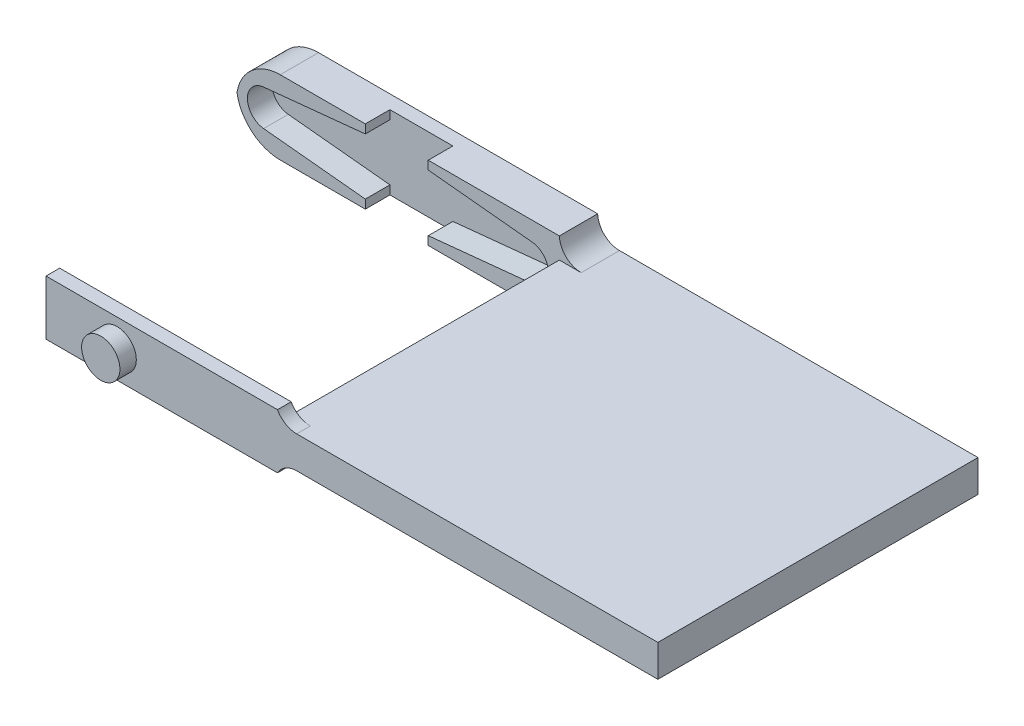
ISO-10303-21;
HEADER;
FILE_DESCRIPTION(('STEP AP214'),'2;1');
FILE_NAME('part.step','',(''),(''),'','','');
FILE_SCHEMA(('AUTOMOTIVE_DESIGN { 1 0 10303 214 1 1 1 1 }'));
ENDSEC;
DATA;
#1=APPLICATION_CONTEXT('core data for automotive mechanical design processes');
#2=APPLICATION_PROTOCOL_DEFINITION('international standard','automotive_design',2000,#1);
#3=PRODUCT_CONTEXT('',#1,'mechanical');
#4=PRODUCT('Part','Part','',(#3));
#5=PRODUCT_RELATED_PRODUCT_CATEGORY('part','',(#4));
#6=PRODUCT_DEFINITION_FORMATION('','',#4);
#7=PRODUCT_DEFINITION_CONTEXT('part definition',#1,'design');
#8=PRODUCT_DEFINITION('design','',#6,#7);
#9=PRODUCT_DEFINITION_SHAPE('','',#8);
#10=(LENGTH_UNIT() NAMED_UNIT(*) SI_UNIT(.MILLI.,.METRE.));
#11=(NAMED_UNIT(*) PLANE_ANGLE_UNIT() SI_UNIT($,.RADIAN.));
#12=(NAMED_UNIT(*) SI_UNIT($,.STERADIAN.) SOLID_ANGLE_UNIT());
#13=UNCERTAINTY_MEASURE_WITH_UNIT(LENGTH_MEASURE(1.E-05),#10,'distance_accuracy_value','');
#14=(GEOMETRIC_REPRESENTATION_CONTEXT(3) GLOBAL_UNCERTAINTY_ASSIGNED_CONTEXT((#13)) GLOBAL_UNIT_ASSIGNED_CONTEXT((#10,
#11,#12)) REPRESENTATION_CONTEXT('',''));
#15=CARTESIAN_POINT('',(0.,0.,0.));
#16=DIRECTION('',(0.,0.,1.));
#17=DIRECTION('',(1.,0.,0.));
#18=AXIS2_PLACEMENT_3D('',#15,#16,#17);
#19=CARTESIAN_POINT('',(0.,0.,29.25));
#20=DIRECTION('',(0.,0.,1.));
#21=DIRECTION('',(1.,0.,0.));
#22=AXIS2_PLACEMENT_3D('',#19,#20,#21);
#23=PLANE('',#22);
#24=DIRECTION('',(1.,0.,0.));
#25=VECTOR('',#24,1.);
#26=CARTESIAN_POINT('',(0.,4.83707186120483,29.25));
#27=LINE('',#26,#25);
#28=CARTESIAN_POINT('',(16.5034017605437,4.83707186120483,29.25));
#29=VERTEX_POINT('',#28);
#30=CARTESIAN_POINT('',(49.5,4.83707186120483,29.25));
#31=VERTEX_POINT('',#30);
#32=EDGE_CURVE('E509',#29,#31,#27,.T.);
#33=ORIENTED_EDGE('',*,*,#32,.F.);
#34=CARTESIAN_POINT('',(16.5034017605437,6.83707186120483,29.25));
#35=DIRECTION('',(0.,0.,1.));
#36=DIRECTION('',(1.,0.,0.));
#37=AXIS2_PLACEMENT_3D('',#34,#35,#36);
#38=CIRCLE('',#37,2.);
#39=CARTESIAN_POINT('',(14.75,5.87500000000001,29.25));
#40=VERTEX_POINT('',#39);
#41=EDGE_CURVE('E445',#29,#40,#38,.F.);
#42=ORIENTED_EDGE('',*,*,#41,.T.);
#43=DIRECTION('',(1.,0.,0.));
#44=VECTOR('',#43,1.);
#45=CARTESIAN_POINT('',(0.,5.87500000000001,29.25));
#46=LINE('',#45,#44);
#47=CARTESIAN_POINT('',(-6.4,5.875,29.25));
#48=VERTEX_POINT('',#47);
#49=EDGE_CURVE('E470',#48,#40,#46,.T.);
#50=ORIENTED_EDGE('',*,*,#49,.F.);
#51=DIRECTION('',(0.,-1.,0.));
#52=VECTOR('',#51,1.);
#53=CARTESIAN_POINT('',(-6.4,0.,29.25));
#54=LINE('',#53,#52);
#55=CARTESIAN_POINT('',(-6.4,0.875000000000003,29.25));
#56=VERTEX_POINT('',#55);
#57=EDGE_CURVE('E473',#48,#56,#54,.T.);
#58=ORIENTED_EDGE('',*,*,#57,.T.);
#59=DIRECTION('',(1.,0.,0.));
#60=VECTOR('',#59,1.);
#61=CARTESIAN_POINT('',(0.,0.875000000000003,29.25));
#62=LINE('',#61,#60);
#63=CARTESIAN_POINT('',(14.75,0.875000000000003,29.25));
#64=VERTEX_POINT('',#63);
#65=EDGE_CURVE('E488',#56,#64,#62,.T.);
#66=ORIENTED_EDGE('',*,*,#65,.T.);
#67=CARTESIAN_POINT('',(16.5034017605437,-0.0870718612048299,29.25));
#68=DIRECTION('',(0.,0.,1.));
#69=DIRECTION('',(1.,0.,0.));
#70=AXIS2_PLACEMENT_3D('',#67,#68,#69);
#71=CIRCLE('',#70,2.);
#72=CARTESIAN_POINT('',(16.5034017605437,1.91292813879517,29.25));
#73=VERTEX_POINT('',#72);
#74=EDGE_CURVE('E449',#64,#73,#71,.F.);
#75=ORIENTED_EDGE('',*,*,#74,.T.);
#76=DIRECTION('',(1.,0.,0.));
#77=VECTOR('',#76,1.);
#78=CARTESIAN_POINT('',(0.,1.91292813879517,29.25));
#79=LINE('',#78,#77);
#80=CARTESIAN_POINT('',(49.5,1.91292813879517,29.25));
#81=VERTEX_POINT('',#80);
#82=EDGE_CURVE('E511',#73,#81,#79,.T.);
#83=ORIENTED_EDGE('',*,*,#82,.T.);
#84=DIRECTION('',(0.,-1.,0.));
#85=VECTOR('',#84,1.);
#86=CARTESIAN_POINT('',(49.5,0.,29.25));
#87=LINE('',#86,#85);
#88=EDGE_CURVE('E513',#31,#81,#87,.T.);
#89=ORIENTED_EDGE('',*,*,#88,.F.);
#90=EDGE_LOOP('',(#33,#42,#50,#58,#66,#75,#83,#89));
#91=FACE_BOUND('',#90,.T.);
#92=CARTESIAN_POINT('',(0.102107464173345,3.37499999999948,29.25));
#93=DIRECTION('',(0.,0.,1.));
#94=DIRECTION('',(1.,0.,0.));
#95=AXIS2_PLACEMENT_3D('',#92,#93,#94);
#96=CIRCLE('',#95,1.75000000000021);
#97=CARTESIAN_POINT('',(1.85210746417356,3.37499999999948,29.25));
#98=VERTEX_POINT('',#97);
#99=EDGE_CURVE('E592',#98,#98,#96,.T.);
#100=ORIENTED_EDGE('',*,*,#99,.F.);
#101=EDGE_LOOP('',(#100));
#102=FACE_BOUND('',#101,.T.);
#103=ADVANCED_FACE('F139',(#91,#102),#23,.T.);
#104=CARTESIAN_POINT('',(0.,0.,3.5));
#105=DIRECTION('',(0.,0.,1.));
#106=DIRECTION('',(1.,0.,0.));
#107=AXIS2_PLACEMENT_3D('',#104,#105,#106);
#108=PLANE('',#107);
#109=DIRECTION('',(0.,-1.,0.));
#110=VECTOR('',#109,1.);
#111=CARTESIAN_POINT('',(-2.97710746417322,0.,3.5));
#112=LINE('',#111,#110);
#113=CARTESIAN_POINT('',(-2.97710746417322,0.799354218210037,3.5));
#114=VERTEX_POINT('',#113);
#115=CARTESIAN_POINT('',(-2.97710746417322,0.,3.5));
#116=VERTEX_POINT('',#115);
#117=EDGE_CURVE('E330',#114,#116,#112,.T.);
#118=ORIENTED_EDGE('',*,*,#117,.F.);
#119=DIRECTION('',(0.994982658758142,-0.10004753255617,0.));
#120=VECTOR('',#119,1.);
#121=CARTESIAN_POINT('',(0.0497727799724651,0.494995245614711,3.5));
#122=LINE('',#121,#120);
#123=CARTESIAN_POINT('',(-12.2650784287177,1.73327861304907,3.5));
#124=VERTEX_POINT('',#123);
#125=EDGE_CURVE('E370',#124,#114,#122,.T.);
#126=ORIENTED_EDGE('',*,*,#125,.F.);
#127=CARTESIAN_POINT('',(-12.1,3.375,3.5));
#128=DIRECTION('',(0.,0.,1.));
#129=DIRECTION('',(1.,0.,0.));
#130=AXIS2_PLACEMENT_3D('',#127,#128,#129);
#131=CIRCLE('',#130,1.65);
#132=CARTESIAN_POINT('',(-12.2650784287177,5.01672138695093,3.5));
#133=VERTEX_POINT('',#132);
#134=EDGE_CURVE('E372',#133,#124,#131,.T.);
#135=ORIENTED_EDGE('',*,*,#134,.F.);
#136=DIRECTION('',(0.994982658758143,0.100047532556171,0.));
#137=VECTOR('',#136,1.);
#138=CARTESIAN_POINT('',(-0.622159749655816,6.18744057018389,3.5));
#139=LINE('',#138,#137);
#140=CARTESIAN_POINT('',(-2.97710746417322,5.95064578178996,3.5));
#141=VERTEX_POINT('',#140);
#142=EDGE_CURVE('E375',#133,#141,#139,.T.);
#143=ORIENTED_EDGE('',*,*,#142,.T.);
#144=DIRECTION('',(0.,-1.,0.));
#145=VECTOR('',#144,1.);
#146=CARTESIAN_POINT('',(-2.97710746417322,6.75000000000014,3.5));
#147=LINE('',#146,#145);
#148=CARTESIAN_POINT('',(-2.97710746417322,6.75000000000014,3.5));
#149=VERTEX_POINT('',#148);
#150=EDGE_CURVE('E605',#149,#141,#147,.T.);
#151=ORIENTED_EDGE('',*,*,#150,.F.);
#152=DIRECTION('',(1.,0.,0.));
#153=VECTOR('',#152,1.);
#154=CARTESIAN_POINT('',(0.,6.75,3.5));
#155=LINE('',#154,#153);
#156=CARTESIAN_POINT('',(-10.75,6.75,3.5));
#157=VERTEX_POINT('',#156);
#158=EDGE_CURVE('E361',#157,#149,#155,.T.);
#159=ORIENTED_EDGE('',*,*,#158,.F.);
#160=CARTESIAN_POINT('',(-10.75,2.75,3.5));
#161=DIRECTION('',(0.,0.,1.));
#162=DIRECTION('',(1.,0.,0.));
#163=AXIS2_PLACEMENT_3D('',#160,#161,#162);
#164=CIRCLE('',#163,4.);
#165=CARTESIAN_POINT('',(-14.7008701573198,3.37499999999999,3.5));
#166=VERTEX_POINT('',#165);
#167=EDGE_CURVE('E148',#157,#166,#164,.T.);
#168=ORIENTED_EDGE('',*,*,#167,.T.);
#169=CARTESIAN_POINT('',(-10.75,4.,3.5));
#170=DIRECTION('',(0.,0.,1.));
#171=DIRECTION('',(1.,0.,0.));
#172=AXIS2_PLACEMENT_3D('',#169,#170,#171);
#173=CIRCLE('',#172,4.);
#174=CARTESIAN_POINT('',(-10.75,0.,3.5));
#175=VERTEX_POINT('',#174);
#176=EDGE_CURVE('E354',#166,#175,#173,.T.);
#177=ORIENTED_EDGE('',*,*,#176,.T.);
#178=DIRECTION('',(1.,0.,0.));
#179=VECTOR('',#178,1.);
#180=CARTESIAN_POINT('',(0.,0.,3.5));
#181=LINE('',#180,#179);
#182=EDGE_CURVE('E347',#175,#116,#181,.T.);
#183=ORIENTED_EDGE('',*,*,#182,.T.);
#184=EDGE_LOOP('',(#118,#126,#135,#143,#151,#159,#168,#177,#183));
#185=FACE_BOUND('',#184,.T.);
#186=ADVANCED_FACE('F352',(#185),#108,.T.);
#187=CARTESIAN_POINT('',(14.75,0.,29.25));
#188=DIRECTION('',(1.,0.,0.));
#189=DIRECTION('',(0.,1.,0.));
#190=AXIS2_PLACEMENT_3D('',#187,#188,#189);
#191=PLANE('',#190);
#192=DIRECTION('',(0.,-1.,0.));
#193=VECTOR('',#192,1.);
#194=CARTESIAN_POINT('',(14.75,0.,28.));
#195=LINE('',#194,#193);
#196=CARTESIAN_POINT('',(14.75,4.83707186120483,28.));
#197=VERTEX_POINT('',#196);
#198=CARTESIAN_POINT('',(14.75,1.91292813879517,28.));
#199=VERTEX_POINT('',#198);
#200=EDGE_CURVE('E484',#197,#199,#195,.T.);
#201=ORIENTED_EDGE('',*,*,#200,.F.);
#202=DIRECTION('',(0.,0.,-1.));
#203=VECTOR('',#202,1.);
#204=CARTESIAN_POINT('',(14.75,4.83707186120483,29.25));
#205=LINE('',#204,#203);
#206=CARTESIAN_POINT('',(14.75,4.83707186120483,3.5));
#207=VERTEX_POINT('',#206);
#208=EDGE_CURVE('E527',#197,#207,#205,.T.);
#209=ORIENTED_EDGE('',*,*,#208,.T.);
#210=DIRECTION('',(0.,-1.,0.));
#211=VECTOR('',#210,1.);
#212=CARTESIAN_POINT('',(14.75,0.,3.5));
#213=LINE('',#212,#211);
#214=CARTESIAN_POINT('',(14.75,1.91292813879517,3.5));
#215=VERTEX_POINT('',#214);
#216=EDGE_CURVE('E384',#207,#215,#213,.T.);
#217=ORIENTED_EDGE('',*,*,#216,.T.);
#218=DIRECTION('',(0.,0.,-1.));
#219=VECTOR('',#218,1.);
#220=CARTESIAN_POINT('',(14.75,1.91292813879517,29.25));
#221=LINE('',#220,#219);
#222=EDGE_CURVE('E524',#199,#215,#221,.T.);
#223=ORIENTED_EDGE('',*,*,#222,.F.);
#224=EDGE_LOOP('',(#201,#209,#217,#223));
#225=FACE_BOUND('',#224,.T.);
#226=ADVANCED_FACE('F647',(#225),#191,.F.);
#227=CARTESIAN_POINT('',(0.622159749655816,6.18744057018389,3.5));
#228=DIRECTION('',(-0.100047532556171,-0.994982658758142,0.));
#229=DIRECTION('',(0.994982658758142,-0.100047532556171,0.));
#230=AXIS2_PLACEMENT_3D('',#227,#228,#229);
#231=PLANE('',#230);
#232=DIRECTION('',(0.,0.,1.));
#233=VECTOR('',#232,1.);
#234=CARTESIAN_POINT('',(2.77289253582668,5.97118000870574,3.5));
#235=LINE('',#234,#233);
#236=CARTESIAN_POINT('',(2.77289253582668,5.97118000870574,1.25000000000061));
#237=VERTEX_POINT('',#236);
#238=CARTESIAN_POINT('',(2.77289253582668,5.97118000870574,3.5));
#239=VERTEX_POINT('',#238);
#240=EDGE_CURVE('E163',#237,#239,#235,.T.);
#241=ORIENTED_EDGE('',*,*,#240,.F.);
#242=DIRECTION('',(-0.994982658758143,0.100047532556171,0.));
#243=VECTOR('',#242,1.);
#244=CARTESIAN_POINT('',(0.622159749655816,6.18744057018389,1.25));
#245=LINE('',#244,#243);
#246=CARTESIAN_POINT('',(12.2650784287177,5.01672138695093,1.25));
#247=VERTEX_POINT('',#246);
#248=EDGE_CURVE('E533',#247,#237,#245,.T.);
#249=ORIENTED_EDGE('',*,*,#248,.F.);
#250=DIRECTION('',(0.,0.,-1.));
#251=VECTOR('',#250,1.);
#252=CARTESIAN_POINT('',(12.2650784287177,5.01672138695093,3.5));
#253=LINE('',#252,#251);
#254=CARTESIAN_POINT('',(12.2650784287177,5.01672138695093,3.5));
#255=VERTEX_POINT('',#254);
#256=EDGE_CURVE('E395',#255,#247,#253,.T.);
#257=ORIENTED_EDGE('',*,*,#256,.F.);
#258=DIRECTION('',(-0.994982658758143,0.100047532556171,0.));
#259=VECTOR('',#258,1.);
#260=CARTESIAN_POINT('',(0.622159749655816,6.18744057018389,3.5));
#261=LINE('',#260,#259);
#262=EDGE_CURVE('E355',#255,#239,#261,.T.);
#263=ORIENTED_EDGE('',*,*,#262,.T.);
#264=EDGE_LOOP('',(#241,#249,#257,#263));
#265=FACE_BOUND('',#264,.T.);
#266=ADVANCED_FACE('F662',(#265),#231,.T.);
#267=CARTESIAN_POINT('',(12.1,3.375,3.5));
#268=DIRECTION('',(0.,0.,-1.));
#269=DIRECTION('',(-1.,0.,0.));
#270=AXIS2_PLACEMENT_3D('',#267,#268,#269);
#271=CYLINDRICAL_SURFACE('',#270,1.64999999999999);
#272=ORIENTED_EDGE('',*,*,#256,.T.);
#273=CARTESIAN_POINT('',(12.1,3.375,1.25));
#274=DIRECTION('',(0.,0.,1.));
#275=DIRECTION('',(1.,0.,0.));
#276=AXIS2_PLACEMENT_3D('',#273,#274,#275);
#277=CIRCLE('',#276,1.64999999999999);
#278=CARTESIAN_POINT('',(12.2650784287177,1.73327861304907,1.25));
#279=VERTEX_POINT('',#278);
#280=EDGE_CURVE('E530',#247,#279,#277,.F.);
#281=ORIENTED_EDGE('',*,*,#280,.T.);
#282=DIRECTION('',(0.,0.,-1.));
#283=VECTOR('',#282,1.);
#284=CARTESIAN_POINT('',(12.2650784287177,1.73327861304907,3.5));
#285=LINE('',#284,#283);
#286=CARTESIAN_POINT('',(12.2650784287177,1.73327861304907,3.5));
#287=VERTEX_POINT('',#286);
#288=EDGE_CURVE('E392',#287,#279,#285,.T.);
#289=ORIENTED_EDGE('',*,*,#288,.F.);
#290=CARTESIAN_POINT('',(12.1,3.375,3.5));
#291=DIRECTION('',(0.,0.,1.));
#292=DIRECTION('',(1.,0.,0.));
#293=AXIS2_PLACEMENT_3D('',#290,#291,#292);
#294=CIRCLE('',#293,1.64999999999999);
#295=EDGE_CURVE('E359',#255,#287,#294,.F.);
#296=ORIENTED_EDGE('',*,*,#295,.F.);
#297=EDGE_LOOP('',(#272,#281,#289,#296));
#298=FACE_BOUND('',#297,.T.);
#299=ADVANCED_FACE('F638',(#298),#271,.F.);
#300=CARTESIAN_POINT('',(-0.0497727799724653,0.49499524561471,3.5));
#301=DIRECTION('',(0.100047532556171,-0.994982658758142,0.));
#302=DIRECTION('',(0.994982658758143,0.100047532556171,0.));
#303=AXIS2_PLACEMENT_3D('',#300,#301,#302);
#304=PLANE('',#303);
#305=DIRECTION('',(-0.994982658758142,-0.100047532556171,0.));
#306=VECTOR('',#305,1.);
#307=CARTESIAN_POINT('',(-0.0497727799724653,0.49499524561471,1.25));
#308=LINE('',#307,#306);
#309=CARTESIAN_POINT('',(2.77289253582668,0.778819991294258,1.25000000000061));
#310=VERTEX_POINT('',#309);
#311=EDGE_CURVE('E382',#279,#310,#308,.T.);
#312=ORIENTED_EDGE('',*,*,#311,.T.);
#313=DIRECTION('',(0.,0.,1.));
#314=VECTOR('',#313,1.);
#315=CARTESIAN_POINT('',(2.77289253582668,0.778819991294258,3.5));
#316=LINE('',#315,#314);
#317=CARTESIAN_POINT('',(2.77289253582668,0.778819991294258,3.5));
#318=VERTEX_POINT('',#317);
#319=EDGE_CURVE('E599',#310,#318,#316,.T.);
#320=ORIENTED_EDGE('',*,*,#319,.T.);
#321=DIRECTION('',(-0.994982658758142,-0.100047532556171,0.));
#322=VECTOR('',#321,1.);
#323=CARTESIAN_POINT('',(-0.0497727799724653,0.49499524561471,3.5));
#324=LINE('',#323,#322);
#325=EDGE_CURVE('E367',#287,#318,#324,.T.);
#326=ORIENTED_EDGE('',*,*,#325,.F.);
#327=ORIENTED_EDGE('',*,*,#288,.T.);
#328=EDGE_LOOP('',(#312,#320,#326,#327));
#329=FACE_BOUND('',#328,.T.);
#330=ADVANCED_FACE('F631',(#329),#304,.F.);
#331=CARTESIAN_POINT('',(0.0497727799724651,0.494995245614711,3.5));
#332=DIRECTION('',(0.10004753255617,0.994982658758143,0.));
#333=DIRECTION('',(-0.994982658758143,0.10004753255617,0.));
#334=AXIS2_PLACEMENT_3D('',#331,#332,#333);
#335=PLANE('',#334);
#336=DIRECTION('',(0.,0.,1.));
#337=VECTOR('',#336,1.);
#338=CARTESIAN_POINT('',(-2.97710746417322,0.799354218210037,3.5));
#339=LINE('',#338,#337);
#340=CARTESIAN_POINT('',(-2.97710746417322,0.799354218210037,1.25000000000061));
#341=VERTEX_POINT('',#340);
#342=EDGE_CURVE('E336',#341,#114,#339,.T.);
#343=ORIENTED_EDGE('',*,*,#342,.F.);
#344=DIRECTION('',(0.994982658758142,-0.10004753255617,0.));
#345=VECTOR('',#344,1.);
#346=CARTESIAN_POINT('',(0.0497727799724651,0.494995245614711,1.25));
#347=LINE('',#346,#345);
#348=CARTESIAN_POINT('',(-12.2650784287177,1.73327861304907,1.25));
#349=VERTEX_POINT('',#348);
#350=EDGE_CURVE('E540',#349,#341,#347,.T.);
#351=ORIENTED_EDGE('',*,*,#350,.F.);
#352=DIRECTION('',(0.,0.,-1.));
#353=VECTOR('',#352,1.);
#354=CARTESIAN_POINT('',(-12.2650784287177,1.73327861304907,3.5));
#355=LINE('',#354,#353);
#356=EDGE_CURVE('E388',#124,#349,#355,.T.);
#357=ORIENTED_EDGE('',*,*,#356,.F.);
#358=ORIENTED_EDGE('',*,*,#125,.T.);
#359=EDGE_LOOP('',(#343,#351,#357,#358));
#360=FACE_BOUND('',#359,.T.);
#361=ADVANCED_FACE('F629',(#360),#335,.T.);
#362=CARTESIAN_POINT('',(-12.1,3.375,3.5));
#363=DIRECTION('',(0.,0.,-1.));
#364=DIRECTION('',(-1.,0.,0.));
#365=AXIS2_PLACEMENT_3D('',#362,#363,#364);
#366=CYLINDRICAL_SURFACE('',#365,1.65);
#367=CARTESIAN_POINT('',(-12.1,3.375,1.25));
#368=DIRECTION('',(0.,0.,1.));
#369=DIRECTION('',(1.,0.,0.));
#370=AXIS2_PLACEMENT_3D('',#367,#368,#369);
#371=CIRCLE('',#370,1.65);
#372=CARTESIAN_POINT('',(-12.2650784287177,5.01672138695093,1.25));
#373=VERTEX_POINT('',#372);
#374=EDGE_CURVE('E538',#373,#349,#371,.T.);
#375=ORIENTED_EDGE('',*,*,#374,.F.);
#376=DIRECTION('',(0.,0.,-1.));
#377=VECTOR('',#376,1.);
#378=CARTESIAN_POINT('',(-12.2650784287177,5.01672138695093,3.5));
#379=LINE('',#378,#377);
#380=EDGE_CURVE('E385',#133,#373,#379,.T.);
#381=ORIENTED_EDGE('',*,*,#380,.F.);
#382=ORIENTED_EDGE('',*,*,#134,.T.);
#383=ORIENTED_EDGE('',*,*,#356,.T.);
#384=EDGE_LOOP('',(#375,#381,#382,#383));
#385=FACE_BOUND('',#384,.T.);
#386=ADVANCED_FACE('F624',(#385),#366,.F.);
#387=CARTESIAN_POINT('',(0.,6.75,3.5));
#388=DIRECTION('',(0.,1.,0.));
#389=DIRECTION('',(0.,0.,1.));
#390=AXIS2_PLACEMENT_3D('',#387,#388,#389);
#391=PLANE('',#390);
#392=DIRECTION('',(0.,0.,1.));
#393=VECTOR('',#392,1.);
#394=CARTESIAN_POINT('',(-2.97710746417322,6.75000000000014,-4.6090208226283));
#395=LINE('',#394,#393);
#396=CARTESIAN_POINT('',(-2.97710746417322,6.75000000000014,1.25000000000061));
#397=VERTEX_POINT('',#396);
#398=EDGE_CURVE('E480',#397,#149,#395,.T.);
#399=ORIENTED_EDGE('',*,*,#398,.F.);
#400=DIRECTION('',(-1.,0.,0.));
#401=VECTOR('',#400,1.);
#402=CARTESIAN_POINT('',(-2.97710746417322,6.75000000000014,1.25000000000061));
#403=LINE('',#402,#401);
#404=CARTESIAN_POINT('',(2.77289253582668,6.75000000000014,1.25000000000061));
#405=VERTEX_POINT('',#404);
#406=EDGE_CURVE('E613',#405,#397,#403,.T.);
#407=ORIENTED_EDGE('',*,*,#406,.F.);
#408=DIRECTION('',(0.,0.,1.));
#409=VECTOR('',#408,1.);
#410=CARTESIAN_POINT('',(2.77289253582668,6.75000000000014,-4.6090208226283));
#411=LINE('',#410,#409);
#412=CARTESIAN_POINT('',(2.77289253582668,6.75000000000014,3.5));
#413=VERTEX_POINT('',#412);
#414=EDGE_CURVE('E616',#405,#413,#411,.T.);
#415=ORIENTED_EDGE('',*,*,#414,.T.);
#416=CARTESIAN_POINT('',(14.75,6.75,3.5));
#417=VERTEX_POINT('',#416);
#418=EDGE_CURVE('E545',#413,#417,#155,.T.);
#419=ORIENTED_EDGE('',*,*,#418,.T.);
#420=DIRECTION('',(0.,0.,-1.));
#421=VECTOR('',#420,1.);
#422=CARTESIAN_POINT('',(14.75,6.75,3.5));
#423=LINE('',#422,#421);
#424=CARTESIAN_POINT('',(14.75,6.75,0.));
#425=VERTEX_POINT('',#424);
#426=EDGE_CURVE('E389',#417,#425,#423,.T.);
#427=ORIENTED_EDGE('',*,*,#426,.T.);
#428=DIRECTION('',(1.,0.,0.));
#429=VECTOR('',#428,1.);
#430=CARTESIAN_POINT('',(0.,6.75,0.));
#431=LINE('',#430,#429);
#432=CARTESIAN_POINT('',(-10.75,6.75,0.));
#433=VERTEX_POINT('',#432);
#434=EDGE_CURVE('E379',#433,#425,#431,.T.);
#435=ORIENTED_EDGE('',*,*,#434,.F.);
#436=DIRECTION('',(0.,0.,-1.));
#437=VECTOR('',#436,1.);
#438=CARTESIAN_POINT('',(-10.75,6.75,3.5));
#439=LINE('',#438,#437);
#440=EDGE_CURVE('E455',#433,#157,#439,.F.);
#441=ORIENTED_EDGE('',*,*,#440,.T.);
#442=ORIENTED_EDGE('',*,*,#158,.T.);
#443=EDGE_LOOP('',(#399,#407,#415,#419,#427,#435,#441,#442));
#444=FACE_BOUND('',#443,.T.);
#445=ADVANCED_FACE('F553',(#444),#391,.T.);
#446=CARTESIAN_POINT('',(0.,0.,3.5));
#447=DIRECTION('',(0.,1.,0.));
#448=DIRECTION('',(0.,0.,1.));
#449=AXIS2_PLACEMENT_3D('',#446,#447,#448);
#450=PLANE('',#449);
#451=DIRECTION('',(1.,0.,0.));
#452=VECTOR('',#451,1.);
#453=CARTESIAN_POINT('',(-2.97710746417322,0.,1.25000000000061));
#454=LINE('',#453,#452);
#455=CARTESIAN_POINT('',(-2.97710746417322,0.,1.25000000000061));
#456=VERTEX_POINT('',#455);
#457=CARTESIAN_POINT('',(2.77289253582668,0.,1.25000000000061));
#458=VERTEX_POINT('',#457);
#459=EDGE_CURVE('E350',#456,#458,#454,.T.);
#460=ORIENTED_EDGE('',*,*,#459,.F.);
#461=DIRECTION('',(0.,0.,1.));
#462=VECTOR('',#461,1.);
#463=CARTESIAN_POINT('',(-2.97710746417322,0.,-4.6090208226283));
#464=LINE('',#463,#462);
#465=EDGE_CURVE('E333',#456,#116,#464,.T.);
#466=ORIENTED_EDGE('',*,*,#465,.T.);
#467=ORIENTED_EDGE('',*,*,#182,.F.);
#468=DIRECTION('',(0.,0.,-1.));
#469=VECTOR('',#468,1.);
#470=CARTESIAN_POINT('',(-10.75,0.,0.));
#471=LINE('',#470,#469);
#472=CARTESIAN_POINT('',(-10.75,0.,0.));
#473=VERTEX_POINT('',#472);
#474=EDGE_CURVE('E12',#175,#473,#471,.T.);
#475=ORIENTED_EDGE('',*,*,#474,.T.);
#476=DIRECTION('',(1.,0.,0.));
#477=VECTOR('',#476,1.);
#478=CARTESIAN_POINT('',(0.,0.,0.));
#479=LINE('',#478,#477);
#480=CARTESIAN_POINT('',(14.75,0.,0.));
#481=VERTEX_POINT('',#480);
#482=EDGE_CURVE('E381',#473,#481,#479,.T.);
#483=ORIENTED_EDGE('',*,*,#482,.T.);
#484=DIRECTION('',(0.,0.,-1.));
#485=VECTOR('',#484,1.);
#486=CARTESIAN_POINT('',(14.75,0.,3.5));
#487=LINE('',#486,#485);
#488=CARTESIAN_POINT('',(14.75,0.,3.5));
#489=VERTEX_POINT('',#488);
#490=EDGE_CURVE('E378',#489,#481,#487,.T.);
#491=ORIENTED_EDGE('',*,*,#490,.F.);
#492=CARTESIAN_POINT('',(2.77289253582668,0.,3.5));
#493=VERTEX_POINT('',#492);
#494=EDGE_CURVE('E356',#493,#489,#181,.T.);
#495=ORIENTED_EDGE('',*,*,#494,.F.);
#496=DIRECTION('',(0.,0.,1.));
#497=VECTOR('',#496,1.);
#498=CARTESIAN_POINT('',(2.77289253582668,0.,-4.6090208226283));
#499=LINE('',#498,#497);
#500=EDGE_CURVE('E155',#458,#493,#499,.T.);
#501=ORIENTED_EDGE('',*,*,#500,.F.);
#502=EDGE_LOOP('',(#460,#466,#467,#475,#483,#491,#495,#501));
#503=FACE_BOUND('',#502,.T.);
#504=ADVANCED_FACE('F346',(#503),#450,.F.);
#505=CARTESIAN_POINT('',(-0.622159749655816,6.18744057018389,3.5));
#506=DIRECTION('',(-0.100047532556171,0.994982658758142,0.));
#507=DIRECTION('',(-0.994982658758142,-0.100047532556171,0.));
#508=AXIS2_PLACEMENT_3D('',#505,#506,#507);
#509=PLANE('',#508);
#510=DIRECTION('',(0.994982658758143,0.100047532556171,0.));
#511=VECTOR('',#510,1.);
#512=CARTESIAN_POINT('',(-0.622159749655816,6.18744057018389,1.25));
#513=LINE('',#512,#511);
#514=CARTESIAN_POINT('',(-2.97710746417322,5.95064578178996,1.25000000000061));
#515=VERTEX_POINT('',#514);
#516=EDGE_CURVE('E536',#373,#515,#513,.T.);
#517=ORIENTED_EDGE('',*,*,#516,.T.);
#518=DIRECTION('',(0.,0.,1.));
#519=VECTOR('',#518,1.);
#520=CARTESIAN_POINT('',(-2.97710746417322,5.95064578178996,3.5));
#521=LINE('',#520,#519);
#522=EDGE_CURVE('E471',#515,#141,#521,.T.);
#523=ORIENTED_EDGE('',*,*,#522,.T.);
#524=ORIENTED_EDGE('',*,*,#142,.F.);
#525=ORIENTED_EDGE('',*,*,#380,.T.);
#526=EDGE_LOOP('',(#517,#523,#524,#525));
#527=FACE_BOUND('',#526,.T.);
#528=ADVANCED_FACE('F621',(#527),#509,.F.);
#529=DIRECTION('',(0.,1.,0.));
#530=VECTOR('',#529,1.);
#531=CARTESIAN_POINT('',(2.77289253582668,0.,3.5));
#532=LINE('',#531,#530);
#533=EDGE_CURVE('E342',#493,#318,#532,.T.);
#534=ORIENTED_EDGE('',*,*,#533,.F.);
#535=ORIENTED_EDGE('',*,*,#494,.T.);
#536=CARTESIAN_POINT('',(16.7481037237807,-0.0870718612048299,3.5));
#537=DIRECTION('',(0.,0.,1.));
#538=DIRECTION('',(1.,0.,0.));
#539=AXIS2_PLACEMENT_3D('',#536,#537,#538);
#540=CIRCLE('',#539,2.);
#541=CARTESIAN_POINT('',(16.7481037237807,1.91292813879517,3.5));
#542=VERTEX_POINT('',#541);
#543=EDGE_CURVE('E441',#489,#542,#540,.F.);
#544=ORIENTED_EDGE('',*,*,#543,.T.);
#545=DIRECTION('',(1.,0.,0.));
#546=VECTOR('',#545,1.);
#547=CARTESIAN_POINT('',(0.,1.91292813879517,3.5));
#548=LINE('',#547,#546);
#549=EDGE_CURVE('E427',#215,#542,#548,.T.);
#550=ORIENTED_EDGE('',*,*,#549,.F.);
#551=ORIENTED_EDGE('',*,*,#216,.F.);
#552=DIRECTION('',(-1.,0.,0.));
#553=VECTOR('',#552,1.);
#554=CARTESIAN_POINT('',(0.,4.83707186120483,3.5));
#555=LINE('',#554,#553);
#556=CARTESIAN_POINT('',(16.7481037237807,4.83707186120483,3.5));
#557=VERTEX_POINT('',#556);
#558=EDGE_CURVE('E415',#557,#207,#555,.T.);
#559=ORIENTED_EDGE('',*,*,#558,.F.);
#560=CARTESIAN_POINT('',(16.7481037237807,6.83707186120483,3.5));
#561=DIRECTION('',(0.,0.,1.));
#562=DIRECTION('',(1.,0.,0.));
#563=AXIS2_PLACEMENT_3D('',#560,#561,#562);
#564=CIRCLE('',#563,2.);
#565=EDGE_CURVE('E435',#557,#417,#564,.F.);
#566=ORIENTED_EDGE('',*,*,#565,.T.);
#567=ORIENTED_EDGE('',*,*,#418,.F.);
#568=DIRECTION('',(0.,1.,0.));
#569=VECTOR('',#568,1.);
#570=CARTESIAN_POINT('',(2.77289253582668,6.75000000000014,3.5));
#571=LINE('',#570,#569);
#572=EDGE_CURVE('E606',#239,#413,#571,.T.);
#573=ORIENTED_EDGE('',*,*,#572,.F.);
#574=ORIENTED_EDGE('',*,*,#262,.F.);
#575=ORIENTED_EDGE('',*,*,#295,.T.);
#576=ORIENTED_EDGE('',*,*,#325,.T.);
#577=EDGE_LOOP('',(#534,#535,#544,#550,#551,#559,#566,#567,#573,#574,#575,#576));
#578=FACE_BOUND('',#577,.T.);
#579=ADVANCED_FACE('F587',(#578),#108,.T.);
#580=CARTESIAN_POINT('',(0.,0.,0.));
#581=DIRECTION('',(0.,0.,1.));
#582=DIRECTION('',(1.,0.,0.));
#583=AXIS2_PLACEMENT_3D('',#580,#581,#582);
#584=PLANE('',#583);
#585=CARTESIAN_POINT('',(-10.75,4.,0.));
#586=DIRECTION('',(0.,0.,1.));
#587=DIRECTION('',(1.,0.,0.));
#588=AXIS2_PLACEMENT_3D('',#585,#586,#587);
#589=CIRCLE('',#588,4.);
#590=CARTESIAN_POINT('',(-14.7008701573198,3.37499999999999,0.));
#591=VERTEX_POINT('',#590);
#592=EDGE_CURVE('E451',#473,#591,#589,.F.);
#593=ORIENTED_EDGE('',*,*,#592,.T.);
#594=CARTESIAN_POINT('',(-10.75,2.75,0.));
#595=DIRECTION('',(0.,0.,1.));
#596=DIRECTION('',(1.,0.,0.));
#597=AXIS2_PLACEMENT_3D('',#594,#595,#596);
#598=CIRCLE('',#597,4.);
#599=EDGE_CURVE('E453',#591,#433,#598,.F.);
#600=ORIENTED_EDGE('',*,*,#599,.T.);
#601=ORIENTED_EDGE('',*,*,#434,.T.);
#602=CARTESIAN_POINT('',(16.7481037237807,6.83707186120483,0.));
#603=DIRECTION('',(0.,0.,1.));
#604=DIRECTION('',(1.,0.,0.));
#605=AXIS2_PLACEMENT_3D('',#602,#603,#604);
#606=CIRCLE('',#605,2.);
#607=CARTESIAN_POINT('',(16.7481037237807,4.83707186120483,0.));
#608=VERTEX_POINT('',#607);
#609=EDGE_CURVE('E433',#425,#608,#606,.T.);
#610=ORIENTED_EDGE('',*,*,#609,.T.);
#611=DIRECTION('',(1.,0.,0.));
#612=VECTOR('',#611,1.);
#613=CARTESIAN_POINT('',(0.,4.83707186120483,0.));
#614=LINE('',#613,#612);
#615=CARTESIAN_POINT('',(49.5,4.83707186120483,0.));
#616=VERTEX_POINT('',#615);
#617=EDGE_CURVE('E407',#608,#616,#614,.T.);
#618=ORIENTED_EDGE('',*,*,#617,.T.);
#619=DIRECTION('',(0.,-1.,0.));
#620=VECTOR('',#619,1.);
#621=CARTESIAN_POINT('',(49.5,0.,0.));
#622=LINE('',#621,#620);
#623=CARTESIAN_POINT('',(49.5,1.91292813879517,0.));
#624=VERTEX_POINT('',#623);
#625=EDGE_CURVE('E422',#616,#624,#622,.T.);
#626=ORIENTED_EDGE('',*,*,#625,.T.);
#627=DIRECTION('',(1.,0.,0.));
#628=VECTOR('',#627,1.);
#629=CARTESIAN_POINT('',(0.,1.91292813879517,0.));
#630=LINE('',#629,#628);
#631=CARTESIAN_POINT('',(16.7481037237807,1.91292813879517,0.));
#632=VERTEX_POINT('',#631);
#633=EDGE_CURVE('E409',#632,#624,#630,.T.);
#634=ORIENTED_EDGE('',*,*,#633,.F.);
#635=CARTESIAN_POINT('',(16.7481037237807,-0.0870718612048299,0.));
#636=DIRECTION('',(0.,0.,1.));
#637=DIRECTION('',(1.,0.,0.));
#638=AXIS2_PLACEMENT_3D('',#635,#636,#637);
#639=CIRCLE('',#638,2.);
#640=EDGE_CURVE('E438',#632,#481,#639,.T.);
#641=ORIENTED_EDGE('',*,*,#640,.T.);
#642=ORIENTED_EDGE('',*,*,#482,.F.);
#643=EDGE_LOOP('',(#593,#600,#601,#610,#618,#626,#634,#641,#642));
#644=FACE_BOUND('',#643,.T.);
#645=ADVANCED_FACE('F559',(#644),#584,.F.);
#646=CARTESIAN_POINT('',(0.,0.,1.25));
#647=DIRECTION('',(0.,0.,1.));
#648=DIRECTION('',(1.,0.,0.));
#649=AXIS2_PLACEMENT_3D('',#646,#647,#648);
#650=PLANE('',#649);
#651=ORIENTED_EDGE('',*,*,#350,.T.);
#652=DIRECTION('',(0.,-1.,0.));
#653=VECTOR('',#652,1.);
#654=CARTESIAN_POINT('',(-2.97710746417322,0.,1.25000000000061));
#655=LINE('',#654,#653);
#656=EDGE_CURVE('E341',#341,#456,#655,.T.);
#657=ORIENTED_EDGE('',*,*,#656,.T.);
#658=ORIENTED_EDGE('',*,*,#459,.T.);
#659=DIRECTION('',(0.,1.,0.));
#660=VECTOR('',#659,1.);
#661=CARTESIAN_POINT('',(2.77289253582668,0.,1.25000000000061));
#662=LINE('',#661,#660);
#663=EDGE_CURVE('E596',#458,#310,#662,.T.);
#664=ORIENTED_EDGE('',*,*,#663,.T.);
#665=ORIENTED_EDGE('',*,*,#311,.F.);
#666=ORIENTED_EDGE('',*,*,#280,.F.);
#667=ORIENTED_EDGE('',*,*,#248,.T.);
#668=DIRECTION('',(0.,1.,0.));
#669=VECTOR('',#668,1.);
#670=CARTESIAN_POINT('',(2.77289253582668,6.75000000000014,1.25000000000061));
#671=LINE('',#670,#669);
#672=EDGE_CURVE('E612',#237,#405,#671,.T.);
#673=ORIENTED_EDGE('',*,*,#672,.T.);
#674=ORIENTED_EDGE('',*,*,#406,.T.);
#675=DIRECTION('',(0.,-1.,0.));
#676=VECTOR('',#675,1.);
#677=CARTESIAN_POINT('',(-2.97710746417322,6.75000000000014,1.25000000000061));
#678=LINE('',#677,#676);
#679=EDGE_CURVE('E608',#397,#515,#678,.T.);
#680=ORIENTED_EDGE('',*,*,#679,.T.);
#681=ORIENTED_EDGE('',*,*,#516,.F.);
#682=ORIENTED_EDGE('',*,*,#374,.T.);
#683=EDGE_LOOP('',(#651,#657,#658,#664,#665,#666,#667,#673,#674,#680,#681,#682));
#684=FACE_BOUND('',#683,.T.);
#685=ADVANCED_FACE('F627',(#684),#650,.T.);
#686=CARTESIAN_POINT('',(0.,4.83707186120483,29.25));
#687=DIRECTION('',(0.,1.,0.));
#688=DIRECTION('',(0.,0.,1.));
#689=AXIS2_PLACEMENT_3D('',#686,#687,#688);
#690=PLANE('',#689);
#691=ORIENTED_EDGE('',*,*,#617,.F.);
#692=DIRECTION('',(0.,0.,-1.));
#693=VECTOR('',#692,1.);
#694=CARTESIAN_POINT('',(16.7481037237807,4.83707186120483,3.5));
#695=LINE('',#694,#693);
#696=EDGE_CURVE('E417',#608,#557,#695,.F.);
#697=ORIENTED_EDGE('',*,*,#696,.T.);
#698=ORIENTED_EDGE('',*,*,#558,.T.);
#699=ORIENTED_EDGE('',*,*,#208,.F.);
#700=DIRECTION('',(1.,0.,0.));
#701=VECTOR('',#700,1.);
#702=CARTESIAN_POINT('',(0.,4.83707186120483,28.));
#703=LINE('',#702,#701);
#704=CARTESIAN_POINT('',(16.5034017605437,4.83707186120483,28.));
#705=VERTEX_POINT('',#704);
#706=EDGE_CURVE('E412',#197,#705,#703,.T.);
#707=ORIENTED_EDGE('',*,*,#706,.T.);
#708=DIRECTION('',(0.,0.,-1.));
#709=VECTOR('',#708,1.);
#710=CARTESIAN_POINT('',(16.5034017605437,4.83707186120483,29.25));
#711=LINE('',#710,#709);
#712=EDGE_CURVE('E398',#705,#29,#711,.F.);
#713=ORIENTED_EDGE('',*,*,#712,.T.);
#714=ORIENTED_EDGE('',*,*,#32,.T.);
#715=DIRECTION('',(0.,0.,-1.));
#716=VECTOR('',#715,1.);
#717=CARTESIAN_POINT('',(49.5,4.83707186120483,29.25));
#718=LINE('',#717,#716);
#719=EDGE_CURVE('E516',#31,#616,#718,.T.);
#720=ORIENTED_EDGE('',*,*,#719,.T.);
#721=EDGE_LOOP('',(#691,#697,#698,#699,#707,#713,#714,#720));
#722=FACE_BOUND('',#721,.T.);
#723=ADVANCED_FACE('F566',(#722),#690,.T.);
#724=CARTESIAN_POINT('',(0.,1.91292813879517,29.25));
#725=DIRECTION('',(0.,1.,0.));
#726=DIRECTION('',(0.,0.,1.));
#727=AXIS2_PLACEMENT_3D('',#724,#725,#726);
#728=PLANE('',#727);
#729=ORIENTED_EDGE('',*,*,#549,.T.);
#730=DIRECTION('',(0.,0.,1.));
#731=VECTOR('',#730,1.);
#732=CARTESIAN_POINT('',(16.7481037237807,1.91292813879517,29.25));
#733=LINE('',#732,#731);
#734=EDGE_CURVE('E430',#542,#632,#733,.F.);
#735=ORIENTED_EDGE('',*,*,#734,.T.);
#736=ORIENTED_EDGE('',*,*,#633,.T.);
#737=DIRECTION('',(0.,0.,-1.));
#738=VECTOR('',#737,1.);
#739=CARTESIAN_POINT('',(49.5,1.91292813879517,29.25));
#740=LINE('',#739,#738);
#741=EDGE_CURVE('E521',#81,#624,#740,.T.);
#742=ORIENTED_EDGE('',*,*,#741,.F.);
#743=ORIENTED_EDGE('',*,*,#82,.F.);
#744=DIRECTION('',(0.,0.,1.));
#745=VECTOR('',#744,1.);
#746=CARTESIAN_POINT('',(16.5034017605437,1.91292813879517,29.25));
#747=LINE('',#746,#745);
#748=CARTESIAN_POINT('',(16.5034017605437,1.91292813879517,28.));
#749=VERTEX_POINT('',#748);
#750=EDGE_CURVE('E424',#73,#749,#747,.F.);
#751=ORIENTED_EDGE('',*,*,#750,.T.);
#752=DIRECTION('',(-1.,0.,0.));
#753=VECTOR('',#752,1.);
#754=CARTESIAN_POINT('',(0.,1.91292813879517,28.));
#755=LINE('',#754,#753);
#756=EDGE_CURVE('E420',#749,#199,#755,.T.);
#757=ORIENTED_EDGE('',*,*,#756,.T.);
#758=ORIENTED_EDGE('',*,*,#222,.T.);
#759=EDGE_LOOP('',(#729,#735,#736,#742,#743,#751,#757,#758));
#760=FACE_BOUND('',#759,.T.);
#761=ADVANCED_FACE('F577',(#760),#728,.F.);
#762=CARTESIAN_POINT('',(49.5,0.,29.25));
#763=DIRECTION('',(1.,0.,0.));
#764=DIRECTION('',(0.,0.,-1.));
#765=AXIS2_PLACEMENT_3D('',#762,#763,#764);
#766=PLANE('',#765);
#767=ORIENTED_EDGE('',*,*,#625,.F.);
#768=ORIENTED_EDGE('',*,*,#719,.F.);
#769=ORIENTED_EDGE('',*,*,#88,.T.);
#770=ORIENTED_EDGE('',*,*,#741,.T.);
#771=EDGE_LOOP('',(#767,#768,#769,#770));
#772=FACE_BOUND('',#771,.T.);
#773=ADVANCED_FACE('F572',(#772),#766,.T.);
#774=CARTESIAN_POINT('',(-6.4,0.,28.));
#775=DIRECTION('',(-1.,0.,0.));
#776=DIRECTION('',(0.,0.,1.));
#777=AXIS2_PLACEMENT_3D('',#774,#775,#776);
#778=PLANE('',#777);
#779=ORIENTED_EDGE('',*,*,#57,.F.);
#780=DIRECTION('',(0.,0.,1.));
#781=VECTOR('',#780,1.);
#782=CARTESIAN_POINT('',(-6.4,5.875,28.));
#783=LINE('',#782,#781);
#784=CARTESIAN_POINT('',(-6.4,5.875,28.));
#785=VERTEX_POINT('',#784);
#786=EDGE_CURVE('E505',#785,#48,#783,.T.);
#787=ORIENTED_EDGE('',*,*,#786,.F.);
#788=DIRECTION('',(0.,-1.,0.));
#789=VECTOR('',#788,1.);
#790=CARTESIAN_POINT('',(-6.4,0.,28.));
#791=LINE('',#790,#789);
#792=CARTESIAN_POINT('',(-6.4,0.875000000000003,28.));
#793=VERTEX_POINT('',#792);
#794=EDGE_CURVE('E491',#785,#793,#791,.T.);
#795=ORIENTED_EDGE('',*,*,#794,.T.);
#796=DIRECTION('',(0.,0.,1.));
#797=VECTOR('',#796,1.);
#798=CARTESIAN_POINT('',(-6.4,0.875000000000003,28.));
#799=LINE('',#798,#797);
#800=EDGE_CURVE('E503',#793,#56,#799,.T.);
#801=ORIENTED_EDGE('',*,*,#800,.T.);
#802=EDGE_LOOP('',(#779,#787,#795,#801));
#803=FACE_BOUND('',#802,.T.);
#804=ADVANCED_FACE('F657',(#803),#778,.T.);
#805=CARTESIAN_POINT('',(0.,0.875000000000003,28.));
#806=DIRECTION('',(0.,-1.,0.));
#807=DIRECTION('',(1.,0.,0.));
#808=AXIS2_PLACEMENT_3D('',#805,#806,#807);
#809=PLANE('',#808);
#810=ORIENTED_EDGE('',*,*,#65,.F.);
#811=ORIENTED_EDGE('',*,*,#800,.F.);
#812=DIRECTION('',(1.,0.,0.));
#813=VECTOR('',#812,1.);
#814=CARTESIAN_POINT('',(0.,0.875000000000003,28.));
#815=LINE('',#814,#813);
#816=CARTESIAN_POINT('',(14.75,0.875000000000003,28.));
#817=VERTEX_POINT('',#816);
#818=EDGE_CURVE('E494',#793,#817,#815,.T.);
#819=ORIENTED_EDGE('',*,*,#818,.T.);
#820=DIRECTION('',(0.,0.,1.));
#821=VECTOR('',#820,1.);
#822=CARTESIAN_POINT('',(14.75,0.875000000000003,28.));
#823=LINE('',#822,#821);
#824=EDGE_CURVE('E410',#817,#64,#823,.T.);
#825=ORIENTED_EDGE('',*,*,#824,.T.);
#826=EDGE_LOOP('',(#810,#811,#819,#825));
#827=FACE_BOUND('',#826,.T.);
#828=ADVANCED_FACE('F733',(#827),#809,.T.);
#829=CARTESIAN_POINT('',(0.,5.87500000000001,28.));
#830=DIRECTION('',(0.,-1.,0.));
#831=DIRECTION('',(1.,0.,0.));
#832=AXIS2_PLACEMENT_3D('',#829,#830,#831);
#833=PLANE('',#832);
#834=ORIENTED_EDGE('',*,*,#49,.T.);
#835=DIRECTION('',(0.,0.,1.));
#836=VECTOR('',#835,1.);
#837=CARTESIAN_POINT('',(14.75,5.87500000000001,28.));
#838=LINE('',#837,#836);
#839=CARTESIAN_POINT('',(14.75,5.87500000000001,28.));
#840=VERTEX_POINT('',#839);
#841=EDGE_CURVE('E496',#840,#40,#838,.T.);
#842=ORIENTED_EDGE('',*,*,#841,.F.);
#843=DIRECTION('',(1.,0.,0.));
#844=VECTOR('',#843,1.);
#845=CARTESIAN_POINT('',(0.,5.87500000000001,28.));
#846=LINE('',#845,#844);
#847=EDGE_CURVE('E487',#785,#840,#846,.T.);
#848=ORIENTED_EDGE('',*,*,#847,.F.);
#849=ORIENTED_EDGE('',*,*,#786,.T.);
#850=EDGE_LOOP('',(#834,#842,#848,#849));
#851=FACE_BOUND('',#850,.T.);
#852=ADVANCED_FACE('F653',(#851),#833,.F.);
#853=CARTESIAN_POINT('',(0.,0.,28.));
#854=DIRECTION('',(0.,0.,1.));
#855=DIRECTION('',(1.,0.,0.));
#856=AXIS2_PLACEMENT_3D('',#853,#854,#855);
#857=PLANE('',#856);
#858=ORIENTED_EDGE('',*,*,#847,.T.);
#859=CARTESIAN_POINT('',(16.5034017605437,6.83707186120483,28.));
#860=DIRECTION('',(0.,0.,1.));
#861=DIRECTION('',(1.,0.,0.));
#862=AXIS2_PLACEMENT_3D('',#859,#860,#861);
#863=CIRCLE('',#862,2.);
#864=EDGE_CURVE('E443',#840,#705,#863,.T.);
#865=ORIENTED_EDGE('',*,*,#864,.T.);
#866=ORIENTED_EDGE('',*,*,#706,.F.);
#867=ORIENTED_EDGE('',*,*,#200,.T.);
#868=ORIENTED_EDGE('',*,*,#756,.F.);
#869=CARTESIAN_POINT('',(16.5034017605437,-0.0870718612048299,28.));
#870=DIRECTION('',(0.,0.,1.));
#871=DIRECTION('',(1.,0.,0.));
#872=AXIS2_PLACEMENT_3D('',#869,#870,#871);
#873=CIRCLE('',#872,2.);
#874=EDGE_CURVE('E447',#749,#817,#873,.T.);
#875=ORIENTED_EDGE('',*,*,#874,.T.);
#876=ORIENTED_EDGE('',*,*,#818,.F.);
#877=ORIENTED_EDGE('',*,*,#794,.F.);
#878=EDGE_LOOP('',(#858,#865,#866,#867,#868,#875,#876,#877));
#879=FACE_BOUND('',#878,.T.);
#880=ADVANCED_FACE('F684',(#879),#857,.F.);
#881=CARTESIAN_POINT('',(16.7481037237807,6.83707186120483,3.5));
#882=DIRECTION('',(0.,0.,1.));
#883=DIRECTION('',(1.,0.,0.));
#884=AXIS2_PLACEMENT_3D('',#881,#882,#883);
#885=CYLINDRICAL_SURFACE('',#884,2.);
#886=ORIENTED_EDGE('',*,*,#565,.F.);
#887=ORIENTED_EDGE('',*,*,#696,.F.);
#888=ORIENTED_EDGE('',*,*,#609,.F.);
#889=ORIENTED_EDGE('',*,*,#426,.F.);
#890=EDGE_LOOP('',(#886,#887,#888,#889));
#891=FACE_BOUND('',#890,.T.);
#892=ADVANCED_FACE('F564',(#891),#885,.F.);
#893=CARTESIAN_POINT('',(16.7481037237807,-0.0870718612048299,3.5));
#894=DIRECTION('',(0.,0.,1.));
#895=DIRECTION('',(1.,0.,0.));
#896=AXIS2_PLACEMENT_3D('',#893,#894,#895);
#897=CYLINDRICAL_SURFACE('',#896,2.);
#898=ORIENTED_EDGE('',*,*,#543,.F.);
#899=ORIENTED_EDGE('',*,*,#490,.T.);
#900=ORIENTED_EDGE('',*,*,#640,.F.);
#901=ORIENTED_EDGE('',*,*,#734,.F.);
#902=EDGE_LOOP('',(#898,#899,#900,#901));
#903=FACE_BOUND('',#902,.T.);
#904=ADVANCED_FACE('F582',(#903),#897,.F.);
#905=CARTESIAN_POINT('',(16.5034017605437,6.83707186120483,28.));
#906=DIRECTION('',(0.,0.,1.));
#907=DIRECTION('',(1.,0.,0.));
#908=AXIS2_PLACEMENT_3D('',#905,#906,#907);
#909=CYLINDRICAL_SURFACE('',#908,2.);
#910=ORIENTED_EDGE('',*,*,#41,.F.);
#911=ORIENTED_EDGE('',*,*,#712,.F.);
#912=ORIENTED_EDGE('',*,*,#864,.F.);
#913=ORIENTED_EDGE('',*,*,#841,.T.);
#914=EDGE_LOOP('',(#910,#911,#912,#913));
#915=FACE_BOUND('',#914,.T.);
#916=ADVANCED_FACE('F687',(#915),#909,.F.);
#917=CARTESIAN_POINT('',(16.5034017605437,-0.0870718612048299,28.));
#918=DIRECTION('',(0.,0.,1.));
#919=DIRECTION('',(1.,0.,0.));
#920=AXIS2_PLACEMENT_3D('',#917,#918,#919);
#921=CYLINDRICAL_SURFACE('',#920,2.);
#922=ORIENTED_EDGE('',*,*,#74,.F.);
#923=ORIENTED_EDGE('',*,*,#824,.F.);
#924=ORIENTED_EDGE('',*,*,#874,.F.);
#925=ORIENTED_EDGE('',*,*,#750,.F.);
#926=EDGE_LOOP('',(#922,#923,#924,#925));
#927=FACE_BOUND('',#926,.T.);
#928=ADVANCED_FACE('F690',(#927),#921,.F.);
#929=CARTESIAN_POINT('',(-10.75,4.,3.5));
#930=DIRECTION('',(0.,0.,1.));
#931=DIRECTION('',(1.,0.,0.));
#932=AXIS2_PLACEMENT_3D('',#929,#930,#931);
#933=CYLINDRICAL_SURFACE('',#932,4.);
#934=ORIENTED_EDGE('',*,*,#474,.F.);
#935=ORIENTED_EDGE('',*,*,#176,.F.);
#936=DIRECTION('',(0.,0.,1.));
#937=VECTOR('',#936,1.);
#938=CARTESIAN_POINT('',(-14.7008701573198,3.37499999999999,1.75));
#939=LINE('',#938,#937);
#940=EDGE_CURVE('E143',#591,#166,#939,.T.);
#941=ORIENTED_EDGE('',*,*,#940,.F.);
#942=ORIENTED_EDGE('',*,*,#592,.F.);
#943=EDGE_LOOP('',(#934,#935,#941,#942));
#944=FACE_BOUND('',#943,.T.);
#945=ADVANCED_FACE('F141',(#944),#933,.T.);
#946=CARTESIAN_POINT('',(-10.75,2.75,3.5));
#947=DIRECTION('',(0.,0.,-1.));
#948=DIRECTION('',(-1.,0.,0.));
#949=AXIS2_PLACEMENT_3D('',#946,#947,#948);
#950=CYLINDRICAL_SURFACE('',#949,4.);
#951=ORIENTED_EDGE('',*,*,#167,.F.);
#952=ORIENTED_EDGE('',*,*,#440,.F.);
#953=ORIENTED_EDGE('',*,*,#599,.F.);
#954=ORIENTED_EDGE('',*,*,#940,.T.);
#955=EDGE_LOOP('',(#951,#952,#953,#954));
#956=FACE_BOUND('',#955,.T.);
#957=ADVANCED_FACE('F469',(#956),#950,.T.);
#958=CARTESIAN_POINT('',(-2.97710746417322,6.75000000000014,-4.6090208226283));
#959=DIRECTION('',(-1.,0.,0.));
#960=DIRECTION('',(0.,-1.,0.));
#961=AXIS2_PLACEMENT_3D('',#958,#959,#960);
#962=PLANE('',#961);
#963=ORIENTED_EDGE('',*,*,#679,.F.);
#964=ORIENTED_EDGE('',*,*,#398,.T.);
#965=ORIENTED_EDGE('',*,*,#150,.T.);
#966=ORIENTED_EDGE('',*,*,#522,.F.);
#967=EDGE_LOOP('',(#963,#964,#965,#966));
#968=FACE_BOUND('',#967,.T.);
#969=ADVANCED_FACE('F619',(#968),#962,.F.);
#970=CARTESIAN_POINT('',(2.77289253582668,6.75000000000014,-4.6090208226283));
#971=DIRECTION('',(1.,0.,0.));
#972=DIRECTION('',(0.,1.,0.));
#973=AXIS2_PLACEMENT_3D('',#970,#971,#972);
#974=PLANE('',#973);
#975=ORIENTED_EDGE('',*,*,#240,.T.);
#976=ORIENTED_EDGE('',*,*,#572,.T.);
#977=ORIENTED_EDGE('',*,*,#414,.F.);
#978=ORIENTED_EDGE('',*,*,#672,.F.);
#979=EDGE_LOOP('',(#975,#976,#977,#978));
#980=FACE_BOUND('',#979,.T.);
#981=ADVANCED_FACE('F699',(#980),#974,.F.);
#982=CARTESIAN_POINT('',(2.77289253582668,0.,-4.6090208226283));
#983=DIRECTION('',(1.,0.,0.));
#984=DIRECTION('',(0.,0.,-1.));
#985=AXIS2_PLACEMENT_3D('',#982,#983,#984);
#986=PLANE('',#985);
#987=ORIENTED_EDGE('',*,*,#663,.F.);
#988=ORIENTED_EDGE('',*,*,#500,.T.);
#989=ORIENTED_EDGE('',*,*,#533,.T.);
#990=ORIENTED_EDGE('',*,*,#319,.F.);
#991=EDGE_LOOP('',(#987,#988,#989,#990));
#992=FACE_BOUND('',#991,.T.);
#993=ADVANCED_FACE('F900',(#992),#986,.F.);
#994=CARTESIAN_POINT('',(-2.97710746417322,0.,-4.6090208226283));
#995=DIRECTION('',(-1.,0.,0.));
#996=DIRECTION('',(0.,0.,1.));
#997=AXIS2_PLACEMENT_3D('',#994,#995,#996);
#998=PLANE('',#997);
#999=ORIENTED_EDGE('',*,*,#342,.T.);
#1000=ORIENTED_EDGE('',*,*,#117,.T.);
#1001=ORIENTED_EDGE('',*,*,#465,.F.);
#1002=ORIENTED_EDGE('',*,*,#656,.F.);
#1003=EDGE_LOOP('',(#999,#1000,#1001,#1002));
#1004=FACE_BOUND('',#1003,.T.);
#1005=ADVANCED_FACE('F332',(#1004),#998,.F.);
#1006=CARTESIAN_POINT('',(0.102107464173345,3.37499999999948,30.7500000000001));
#1007=DIRECTION('',(0.,0.,-1.));
#1008=DIRECTION('',(-1.,0.,0.));
#1009=AXIS2_PLACEMENT_3D('',#1006,#1007,#1008);
#1010=CYLINDRICAL_SURFACE('',#1009,1.75000000000021);
#1011=CARTESIAN_POINT('',(0.102107464173345,3.37499999999948,30.7500000000001));
#1012=DIRECTION('',(0.,0.,1.));
#1013=DIRECTION('',(1.,0.,0.));
#1014=AXIS2_PLACEMENT_3D('',#1011,#1012,#1013);
#1015=CIRCLE('',#1014,1.75000000000021);
#1016=CARTESIAN_POINT('',(1.85210746417356,3.37499999999948,30.7500000000001));
#1017=VERTEX_POINT('',#1016);
#1018=EDGE_CURVE('E589',#1017,#1017,#1015,.T.);
#1019=ORIENTED_EDGE('',*,*,#1018,.F.);
#1020=EDGE_LOOP('',(#1019));
#1021=FACE_BOUND('',#1020,.T.);
#1022=ORIENTED_EDGE('',*,*,#99,.T.);
#1023=EDGE_LOOP('',(#1022));
#1024=FACE_BOUND('',#1023,.T.);
#1025=ADVANCED_FACE('F915',(#1021,#1024),#1010,.T.);
#1026=CARTESIAN_POINT('',(0.102107464173345,3.37499999999948,30.7500000000001));
#1027=DIRECTION('',(0.,0.,1.));
#1028=DIRECTION('',(1.,0.,0.));
#1029=AXIS2_PLACEMENT_3D('',#1026,#1027,#1028);
#1030=PLANE('',#1029);
#1031=ORIENTED_EDGE('',*,*,#1018,.T.);
#1032=EDGE_LOOP('',(#1031));
#1033=FACE_BOUND('',#1032,.T.);
#1034=ADVANCED_FACE('F933',(#1033),#1030,.T.);
#1035=CLOSED_SHELL('',(#103,#186,#226,#266,#299,#330,#361,#386,#445,#504,#528,#579,#645,#685,
#723,#761,#773,#804,#828,#852,#880,#892,#904,#916,#928,#945,#957,#969,#981,#993,#1005,#1025,#1034));
#1036=MANIFOLD_SOLID_BREP('B2',#1035);
#1037=ADVANCED_BREP_SHAPE_REPRESENTATION('',(#18,#1036),#14);
#1038=SHAPE_DEFINITION_REPRESENTATION(#9,#1037);
ENDSEC;
END-ISO-10303-21;
